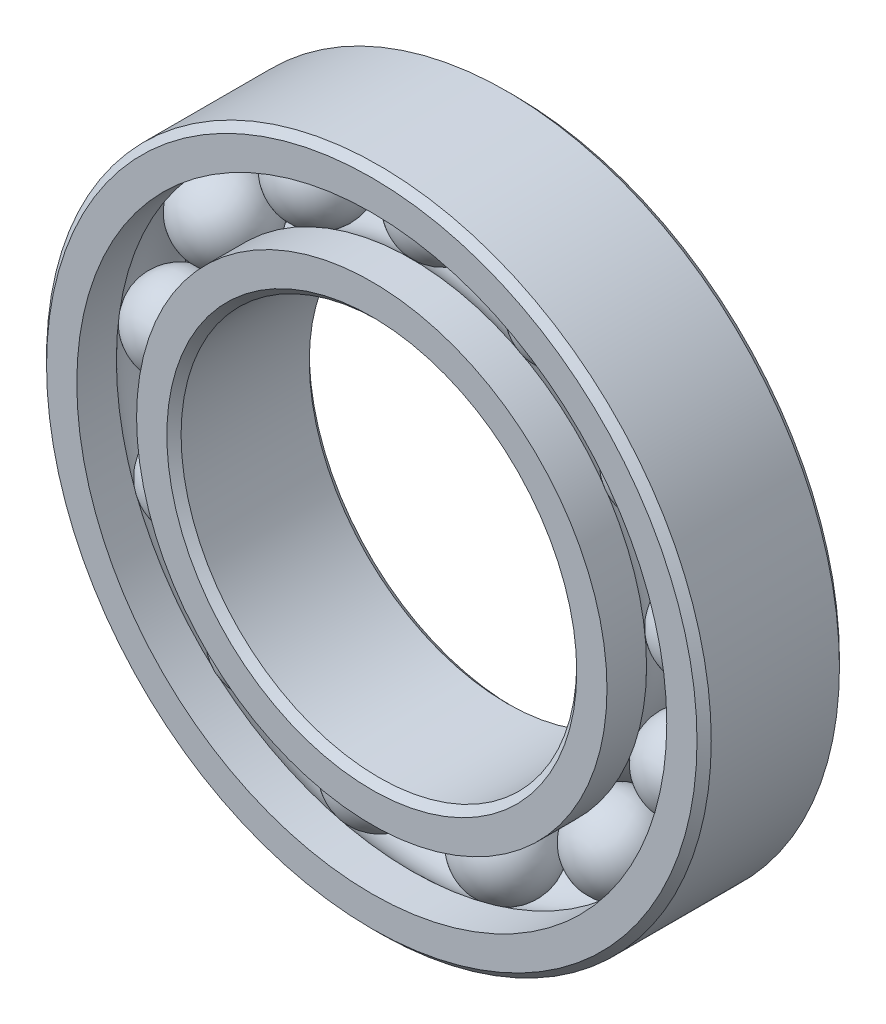
ISO-10303-21;
HEADER;
FILE_DESCRIPTION(('STEP AP214'),'2;1');
FILE_NAME('part.step','',(''),(''),'','','');
FILE_SCHEMA(('AUTOMOTIVE_DESIGN { 1 0 10303 214 1 1 1 1 }'));
ENDSEC;
DATA;
#1=APPLICATION_CONTEXT('core data for automotive mechanical design processes');
#2=APPLICATION_PROTOCOL_DEFINITION('international standard','automotive_design',2000,#1);
#3=PRODUCT_CONTEXT('',#1,'mechanical');
#4=PRODUCT('Part','Part','',(#3));
#5=PRODUCT_RELATED_PRODUCT_CATEGORY('part','',(#4));
#6=PRODUCT_DEFINITION_FORMATION('','',#4);
#7=PRODUCT_DEFINITION_CONTEXT('part definition',#1,'design');
#8=PRODUCT_DEFINITION('design','',#6,#7);
#9=PRODUCT_DEFINITION_SHAPE('','',#8);
#10=(LENGTH_UNIT() NAMED_UNIT(*) SI_UNIT(.MILLI.,.METRE.));
#11=(NAMED_UNIT(*) PLANE_ANGLE_UNIT() SI_UNIT($,.RADIAN.));
#12=(NAMED_UNIT(*) SI_UNIT($,.STERADIAN.) SOLID_ANGLE_UNIT());
#13=UNCERTAINTY_MEASURE_WITH_UNIT(LENGTH_MEASURE(1.E-05),#10,'distance_accuracy_value','');
#14=(GEOMETRIC_REPRESENTATION_CONTEXT(3) GLOBAL_UNCERTAINTY_ASSIGNED_CONTEXT((#13)) GLOBAL_UNIT_ASSIGNED_CONTEXT((#10,
#11,#12)) REPRESENTATION_CONTEXT('',''));
#15=CARTESIAN_POINT('',(0.,0.,0.));
#16=DIRECTION('',(0.,0.,1.));
#17=DIRECTION('',(1.,0.,0.));
#18=AXIS2_PLACEMENT_3D('',#15,#16,#17);
#19=CARTESIAN_POINT('',(7.78411313173294,14.8313884296914,0.));
#20=DIRECTION('',(0.,0.,1.));
#21=DIRECTION('',(0.464723172043757,0.885456025653216,0.));
#22=AXIS2_PLACEMENT_3D('',#19,#20,#21);
#23=SPHERICAL_SURFACE('',#22,2.75098186736443);
#24=CARTESIAN_POINT('',(7.78411313173294,14.8313884296914,2.75098186736443));
#25=VERTEX_POINT('',#24);
#26=VERTEX_LOOP('',#25);
#27=FACE_BOUND('',#26,.T.);
#28=ADVANCED_FACE('F43',(#27),#23,.T.);
#29=CLOSED_SHELL('',(#28));
#30=MANIFOLD_SOLID_BREP('B2',#29);
#31=CARTESIAN_POINT('',(13.7849797537186,9.51508450774703,0.));
#32=DIRECTION('',(0.,0.,1.));
#33=DIRECTION('',(0.822983865893649,0.568064746731166,0.));
#34=AXIS2_PLACEMENT_3D('',#31,#32,#33);
#35=SPHERICAL_SURFACE('',#34,2.75098186736443);
#36=CARTESIAN_POINT('',(13.7849797537186,9.51508450774703,2.75098186736443));
#37=VERTEX_POINT('',#36);
#38=VERTEX_LOOP('',#37);
#39=FACE_BOUND('',#38,.T.);
#40=ADVANCED_FACE('F65',(#39),#35,.T.);
#41=CLOSED_SHELL('',(#40));
#42=MANIFOLD_SOLID_BREP('B6',#41);
#43=CARTESIAN_POINT('',(16.6278736411424,2.01898939427684,0.));
#44=DIRECTION('',(0.,0.,1.));
#45=DIRECTION('',(0.992708874098053,0.120536680255334,0.));
#46=AXIS2_PLACEMENT_3D('',#43,#44,#45);
#47=SPHERICAL_SURFACE('',#46,2.75098186736443);
#48=CARTESIAN_POINT('',(16.6278736411424,2.01898939427684,2.75098186736443));
#49=VERTEX_POINT('',#48);
#50=VERTEX_LOOP('',#49);
#51=FACE_BOUND('',#50,.T.);
#52=ADVANCED_FACE('F87',(#51),#47,.T.);
#53=CLOSED_SHELL('',(#52));
#54=MANIFOLD_SOLID_BREP('B39',#53);
#55=CARTESIAN_POINT('',(15.6615220649808,-5.93963185796232,0.));
#56=DIRECTION('',(0.,0.,1.));
#57=DIRECTION('',(0.935016242685418,-0.354604887042527,0.));
#58=AXIS2_PLACEMENT_3D('',#55,#56,#57);
#59=SPHERICAL_SURFACE('',#58,2.75098186736443);
#60=CARTESIAN_POINT('',(15.6615220649808,-5.93963185796232,2.75098186736443));
#61=VERTEX_POINT('',#60);
#62=VERTEX_LOOP('',#61);
#63=FACE_BOUND('',#62,.T.);
#64=ADVANCED_FACE('F109',(#63),#59,.T.);
#65=CLOSED_SHELL('',(#64));
#66=MANIFOLD_SOLID_BREP('B61',#65);
#67=CARTESIAN_POINT('',(11.1073045255334,-12.5375550318658,0.));
#68=DIRECTION('',(0.,0.,1.));
#69=DIRECTION('',(0.663122658240802,-0.748510748171095,0.));
#70=AXIS2_PLACEMENT_3D('',#67,#68,#69);
#71=SPHERICAL_SURFACE('',#70,2.75098186736443);
#72=CARTESIAN_POINT('',(11.1073045255334,-12.5375550318658,2.75098186736443));
#73=VERTEX_POINT('',#72);
#74=VERTEX_LOOP('',#73);
#75=FACE_BOUND('',#74,.T.);
#76=ADVANCED_FACE('F131',(#75),#71,.T.);
#77=CLOSED_SHELL('',(#76));
#78=MANIFOLD_SOLID_BREP('B83',#77);
#79=CARTESIAN_POINT('',(4.00853737681672,-16.2632754418863,0.));
#80=DIRECTION('',(0.,0.,1.));
#81=DIRECTION('',(0.239315664287565,-0.97094181742605,0.));
#82=AXIS2_PLACEMENT_3D('',#79,#80,#81);
#83=SPHERICAL_SURFACE('',#82,2.75098186736443);
#84=CARTESIAN_POINT('',(4.00853737681672,-16.2632754418863,2.75098186736443));
#85=VERTEX_POINT('',#84);
#86=VERTEX_LOOP('',#85);
#87=FACE_BOUND('',#86,.T.);
#88=ADVANCED_FACE('F153',(#87),#83,.T.);
#89=CLOSED_SHELL('',(#88));
#90=MANIFOLD_SOLID_BREP('B105',#89);
#91=CARTESIAN_POINT('',(-4.00853737681649,-16.2632754418864,0.));
#92=DIRECTION('',(0.,0.,1.));
#93=DIRECTION('',(-0.239315664287552,-0.970941817426054,0.));
#94=AXIS2_PLACEMENT_3D('',#91,#92,#93);
#95=SPHERICAL_SURFACE('',#94,2.75098186736443);
#96=CARTESIAN_POINT('',(-4.00853737681649,-16.2632754418864,2.75098186736443));
#97=VERTEX_POINT('',#96);
#98=VERTEX_LOOP('',#97);
#99=FACE_BOUND('',#98,.T.);
#100=ADVANCED_FACE('F175',(#99),#95,.T.);
#101=CLOSED_SHELL('',(#100));
#102=MANIFOLD_SOLID_BREP('B127',#101);
#103=CARTESIAN_POINT('',(-11.1073045255333,-12.537555031866,0.));
#104=DIRECTION('',(0.,0.,1.));
#105=DIRECTION('',(-0.663122658240791,-0.748510748171105,0.));
#106=AXIS2_PLACEMENT_3D('',#103,#104,#105);
#107=SPHERICAL_SURFACE('',#106,2.75098186736443);
#108=CARTESIAN_POINT('',(-11.1073045255333,-12.537555031866,2.75098186736443));
#109=VERTEX_POINT('',#108);
#110=VERTEX_LOOP('',#109);
#111=FACE_BOUND('',#110,.T.);
#112=ADVANCED_FACE('F197',(#111),#107,.T.);
#113=CLOSED_SHELL('',(#112));
#114=MANIFOLD_SOLID_BREP('B149',#113);
#115=CARTESIAN_POINT('',(-15.6615220649807,-5.93963185796254,0.));
#116=DIRECTION('',(0.,0.,1.));
#117=DIRECTION('',(-0.935016242685413,-0.35460488704254,0.));
#118=AXIS2_PLACEMENT_3D('',#115,#116,#117);
#119=SPHERICAL_SURFACE('',#118,2.75098186736443);
#120=CARTESIAN_POINT('',(-15.6615220649807,-5.93963185796254,2.75098186736443));
#121=VERTEX_POINT('',#120);
#122=VERTEX_LOOP('',#121);
#123=FACE_BOUND('',#122,.T.);
#124=ADVANCED_FACE('F219',(#123),#119,.T.);
#125=CLOSED_SHELL('',(#124));
#126=MANIFOLD_SOLID_BREP('B171',#125);
#127=CARTESIAN_POINT('',(-16.6278736411424,2.01898939427661,0.));
#128=DIRECTION('',(0.,0.,1.));
#129=DIRECTION('',(-0.992708874098054,0.12053668025532,0.));
#130=AXIS2_PLACEMENT_3D('',#127,#128,#129);
#131=SPHERICAL_SURFACE('',#130,2.75098186736443);
#132=CARTESIAN_POINT('',(-16.6278736411424,2.01898939427661,2.75098186736443));
#133=VERTEX_POINT('',#132);
#134=VERTEX_LOOP('',#133);
#135=FACE_BOUND('',#134,.T.);
#136=ADVANCED_FACE('F241',(#135),#131,.T.);
#137=CLOSED_SHELL('',(#136));
#138=MANIFOLD_SOLID_BREP('B193',#137);
#139=CARTESIAN_POINT('',(-13.7849797537188,9.51508450774683,0.));
#140=DIRECTION('',(0.,0.,1.));
#141=DIRECTION('',(-0.822983865893658,0.568064746731154,0.));
#142=AXIS2_PLACEMENT_3D('',#139,#140,#141);
#143=SPHERICAL_SURFACE('',#142,2.75098186736443);
#144=CARTESIAN_POINT('',(-13.7849797537188,9.51508450774683,2.75098186736443));
#145=VERTEX_POINT('',#144);
#146=VERTEX_LOOP('',#145);
#147=FACE_BOUND('',#146,.T.);
#148=ADVANCED_FACE('F263',(#147),#143,.T.);
#149=CLOSED_SHELL('',(#148));
#150=MANIFOLD_SOLID_BREP('B215',#149);
#151=CARTESIAN_POINT('',(-7.78411313173314,14.8313884296913,0.));
#152=DIRECTION('',(0.,0.,1.));
#153=DIRECTION('',(-0.46472317204377,0.885456025653209,0.));
#154=AXIS2_PLACEMENT_3D('',#151,#152,#153);
#155=SPHERICAL_SURFACE('',#154,2.75098186736443);
#156=CARTESIAN_POINT('',(-7.78411313173314,14.8313884296913,2.75098186736443));
#157=VERTEX_POINT('',#156);
#158=VERTEX_LOOP('',#157);
#159=FACE_BOUND('',#158,.T.);
#160=ADVANCED_FACE('F285',(#159),#155,.T.);
#161=CLOSED_SHELL('',(#160));
#162=MANIFOLD_SOLID_BREP('B237',#161);
#163=CARTESIAN_POINT('',(0.,16.75,0.));
#164=DIRECTION('',(0.,0.,1.));
#165=DIRECTION('',(0.,1.,0.));
#166=AXIS2_PLACEMENT_3D('',#163,#164,#165);
#167=SPHERICAL_SURFACE('',#166,2.75098186736443);
#168=CARTESIAN_POINT('',(0.,16.75,2.75098186736443));
#169=VERTEX_POINT('',#168);
#170=VERTEX_LOOP('',#169);
#171=FACE_BOUND('',#170,.T.);
#172=ADVANCED_FACE('F309',(#171),#167,.T.);
#173=CLOSED_SHELL('',(#172));
#174=MANIFOLD_SOLID_BREP('B259',#173);
#175=CARTESIAN_POINT('',(0.,14.8611111111111,4.5));
#176=DIRECTION('',(0.,0.,-1.));
#177=DIRECTION('',(-1.,0.,0.));
#178=AXIS2_PLACEMENT_3D('',#175,#176,#177);
#179=PLANE('',#178);
#180=CARTESIAN_POINT('',(0.,0.,4.5));
#181=DIRECTION('',(0.,0.,1.));
#182=DIRECTION('',(1.,0.,0.));
#183=AXIS2_PLACEMENT_3D('',#180,#181,#182);
#184=CIRCLE('',#183,12.95);
#185=CARTESIAN_POINT('',(12.95,0.,4.5));
#186=VERTEX_POINT('',#185);
#187=EDGE_CURVE('E358',#186,#186,#184,.T.);
#188=ORIENTED_EDGE('',*,*,#187,.F.);
#189=EDGE_LOOP('',(#188));
#190=FACE_BOUND('',#189,.T.);
#191=CARTESIAN_POINT('',(0.,0.,4.5));
#192=DIRECTION('',(0.,0.,1.));
#193=DIRECTION('',(1.,0.,0.));
#194=AXIS2_PLACEMENT_3D('',#191,#192,#193);
#195=CIRCLE('',#194,14.8611111111111);
#196=CARTESIAN_POINT('',(14.8611111111111,0.,4.5));
#197=VERTEX_POINT('',#196);
#198=EDGE_CURVE('E308',#197,#197,#195,.T.);
#199=ORIENTED_EDGE('',*,*,#198,.T.);
#200=EDGE_LOOP('',(#199));
#201=FACE_BOUND('',#200,.T.);
#202=ADVANCED_FACE('F330',(#190,#201),#179,.F.);
#203=CARTESIAN_POINT('',(0.,0.,4.5));
#204=DIRECTION('',(0.,0.,1.));
#205=DIRECTION('',(1.,0.,0.));
#206=AXIS2_PLACEMENT_3D('',#203,#204,#205);
#207=CYLINDRICAL_SURFACE('',#206,14.8611111111111);
#208=ORIENTED_EDGE('',*,*,#198,.F.);
#209=EDGE_LOOP('',(#208));
#210=FACE_BOUND('',#209,.T.);
#211=CARTESIAN_POINT('',(0.,0.,2.));
#212=DIRECTION('',(0.,0.,1.));
#213=DIRECTION('',(1.,0.,0.));
#214=AXIS2_PLACEMENT_3D('',#211,#212,#213);
#215=CIRCLE('',#214,14.8611111111111);
#216=CARTESIAN_POINT('',(14.8611111111111,0.,2.));
#217=VERTEX_POINT('',#216);
#218=EDGE_CURVE('E336',#217,#217,#215,.T.);
#219=ORIENTED_EDGE('',*,*,#218,.T.);
#220=EDGE_LOOP('',(#219));
#221=FACE_BOUND('',#220,.T.);
#222=ADVANCED_FACE('F365',(#210,#221),#207,.T.);
#223=CARTESIAN_POINT('',(0.,0.,0.));
#224=DIRECTION('',(0.,0.,1.));
#225=DIRECTION('',(1.,0.,0.));
#226=AXIS2_PLACEMENT_3D('',#223,#224,#225);
#227=TOROIDAL_SURFACE('',#226,16.75,2.75098186736443);
#228=ORIENTED_EDGE('',*,*,#218,.F.);
#229=EDGE_LOOP('',(#228));
#230=FACE_BOUND('',#229,.T.);
#231=CARTESIAN_POINT('',(0.,0.,-2.));
#232=DIRECTION('',(0.,0.,1.));
#233=DIRECTION('',(1.,0.,0.));
#234=AXIS2_PLACEMENT_3D('',#231,#232,#233);
#235=CIRCLE('',#234,14.8611111111111);
#236=CARTESIAN_POINT('',(14.8611111111111,0.,-2.));
#237=VERTEX_POINT('',#236);
#238=EDGE_CURVE('E340',#237,#237,#235,.T.);
#239=ORIENTED_EDGE('',*,*,#238,.T.);
#240=EDGE_LOOP('',(#239));
#241=FACE_BOUND('',#240,.T.);
#242=ADVANCED_FACE('F369',(#230,#241),#227,.F.);
#243=CARTESIAN_POINT('',(0.,0.,4.5));
#244=DIRECTION('',(0.,0.,1.));
#245=DIRECTION('',(1.,0.,0.));
#246=AXIS2_PLACEMENT_3D('',#243,#244,#245);
#247=CYLINDRICAL_SURFACE('',#246,14.8611111111111);
#248=ORIENTED_EDGE('',*,*,#238,.F.);
#249=EDGE_LOOP('',(#248));
#250=FACE_BOUND('',#249,.T.);
#251=CARTESIAN_POINT('',(0.,0.,-4.5));
#252=DIRECTION('',(0.,0.,1.));
#253=DIRECTION('',(1.,0.,0.));
#254=AXIS2_PLACEMENT_3D('',#251,#252,#253);
#255=CIRCLE('',#254,14.8611111111111);
#256=CARTESIAN_POINT('',(14.8611111111111,0.,-4.5));
#257=VERTEX_POINT('',#256);
#258=EDGE_CURVE('E344',#257,#257,#255,.T.);
#259=ORIENTED_EDGE('',*,*,#258,.T.);
#260=EDGE_LOOP('',(#259));
#261=FACE_BOUND('',#260,.T.);
#262=ADVANCED_FACE('F374',(#250,#261),#247,.T.);
#263=CARTESIAN_POINT('',(0.,12.95,-4.5));
#264=DIRECTION('',(0.,0.,1.));
#265=DIRECTION('',(1.,0.,0.));
#266=AXIS2_PLACEMENT_3D('',#263,#264,#265);
#267=PLANE('',#266);
#268=ORIENTED_EDGE('',*,*,#258,.F.);
#269=EDGE_LOOP('',(#268));
#270=FACE_BOUND('',#269,.T.);
#271=CARTESIAN_POINT('',(0.,0.,-4.5));
#272=DIRECTION('',(0.,0.,1.));
#273=DIRECTION('',(1.,0.,0.));
#274=AXIS2_PLACEMENT_3D('',#271,#272,#273);
#275=CIRCLE('',#274,12.95);
#276=CARTESIAN_POINT('',(12.95,0.,-4.5));
#277=VERTEX_POINT('',#276);
#278=EDGE_CURVE('E349',#277,#277,#275,.T.);
#279=ORIENTED_EDGE('',*,*,#278,.T.);
#280=EDGE_LOOP('',(#279));
#281=FACE_BOUND('',#280,.T.);
#282=ADVANCED_FACE('F380',(#270,#281),#267,.F.);
#283=CARTESIAN_POINT('',(0.,0.,-4.05));
#284=DIRECTION('',(0.,0.,-1.));
#285=DIRECTION('',(-1.,0.,0.));
#286=AXIS2_PLACEMENT_3D('',#283,#284,#285);
#287=CONICAL_SURFACE('',#286,12.5,0.785398163397448);
#288=ORIENTED_EDGE('',*,*,#278,.F.);
#289=EDGE_LOOP('',(#288));
#290=FACE_BOUND('',#289,.T.);
#291=CARTESIAN_POINT('',(0.,0.,-4.05));
#292=DIRECTION('',(0.,0.,1.));
#293=DIRECTION('',(1.,0.,0.));
#294=AXIS2_PLACEMENT_3D('',#291,#292,#293);
#295=CIRCLE('',#294,12.5);
#296=CARTESIAN_POINT('',(12.5,0.,-4.05));
#297=VERTEX_POINT('',#296);
#298=EDGE_CURVE('E352',#297,#297,#295,.T.);
#299=ORIENTED_EDGE('',*,*,#298,.T.);
#300=EDGE_LOOP('',(#299));
#301=FACE_BOUND('',#300,.T.);
#302=ADVANCED_FACE('F384',(#290,#301),#287,.F.);
#303=CARTESIAN_POINT('',(0.,0.,4.5));
#304=DIRECTION('',(0.,0.,1.));
#305=DIRECTION('',(1.,0.,0.));
#306=AXIS2_PLACEMENT_3D('',#303,#304,#305);
#307=CYLINDRICAL_SURFACE('',#306,12.5);
#308=ORIENTED_EDGE('',*,*,#298,.F.);
#309=EDGE_LOOP('',(#308));
#310=FACE_BOUND('',#309,.T.);
#311=CARTESIAN_POINT('',(0.,0.,4.05));
#312=DIRECTION('',(0.,0.,1.));
#313=DIRECTION('',(1.,0.,0.));
#314=AXIS2_PLACEMENT_3D('',#311,#312,#313);
#315=CIRCLE('',#314,12.5);
#316=CARTESIAN_POINT('',(12.5,0.,4.05));
#317=VERTEX_POINT('',#316);
#318=EDGE_CURVE('E355',#317,#317,#315,.T.);
#319=ORIENTED_EDGE('',*,*,#318,.T.);
#320=EDGE_LOOP('',(#319));
#321=FACE_BOUND('',#320,.T.);
#322=ADVANCED_FACE('F388',(#310,#321),#307,.F.);
#323=CARTESIAN_POINT('',(0.,0.,4.5));
#324=DIRECTION('',(0.,0.,1.));
#325=DIRECTION('',(1.,0.,0.));
#326=AXIS2_PLACEMENT_3D('',#323,#324,#325);
#327=CONICAL_SURFACE('',#326,12.95,0.785398163397449);
#328=ORIENTED_EDGE('',*,*,#318,.F.);
#329=EDGE_LOOP('',(#328));
#330=FACE_BOUND('',#329,.T.);
#331=ORIENTED_EDGE('',*,*,#187,.T.);
#332=EDGE_LOOP('',(#331));
#333=FACE_BOUND('',#332,.T.);
#334=ADVANCED_FACE('F362',(#330,#333),#327,.F.);
#335=CLOSED_SHELL('',(#202,#222,#242,#262,#282,#302,#322,#334));
#336=MANIFOLD_SOLID_BREP('B281',#335);
#337=CARTESIAN_POINT('',(0.,0.,4.05));
#338=DIRECTION('',(0.,0.,-1.));
#339=DIRECTION('',(-1.,0.,0.));
#340=AXIS2_PLACEMENT_3D('',#337,#338,#339);
#341=CONICAL_SURFACE('',#340,21.,0.785398163397449);
#342=CARTESIAN_POINT('',(0.,0.,4.5));
#343=DIRECTION('',(0.,0.,1.));
#344=DIRECTION('',(1.,0.,0.));
#345=AXIS2_PLACEMENT_3D('',#342,#343,#344);
#346=CIRCLE('',#345,20.55);
#347=CARTESIAN_POINT('',(20.55,0.,4.5));
#348=VERTEX_POINT('',#347);
#349=EDGE_CURVE('E495',#348,#348,#346,.T.);
#350=ORIENTED_EDGE('',*,*,#349,.F.);
#351=EDGE_LOOP('',(#350));
#352=FACE_BOUND('',#351,.T.);
#353=CARTESIAN_POINT('',(0.,0.,4.05));
#354=DIRECTION('',(0.,0.,1.));
#355=DIRECTION('',(1.,0.,0.));
#356=AXIS2_PLACEMENT_3D('',#353,#354,#355);
#357=CIRCLE('',#356,21.);
#358=CARTESIAN_POINT('',(21.,0.,4.05));
#359=VERTEX_POINT('',#358);
#360=EDGE_CURVE('E329',#359,#359,#357,.T.);
#361=ORIENTED_EDGE('',*,*,#360,.T.);
#362=EDGE_LOOP('',(#361));
#363=FACE_BOUND('',#362,.T.);
#364=ADVANCED_FACE('F467',(#352,#363),#341,.T.);
#365=CARTESIAN_POINT('',(0.,0.,4.5));
#366=DIRECTION('',(0.,0.,1.));
#367=DIRECTION('',(1.,0.,0.));
#368=AXIS2_PLACEMENT_3D('',#365,#366,#367);
#369=CYLINDRICAL_SURFACE('',#368,21.);
#370=ORIENTED_EDGE('',*,*,#360,.F.);
#371=EDGE_LOOP('',(#370));
#372=FACE_BOUND('',#371,.T.);
#373=CARTESIAN_POINT('',(0.,0.,-4.05));
#374=DIRECTION('',(0.,0.,1.));
#375=DIRECTION('',(1.,0.,0.));
#376=AXIS2_PLACEMENT_3D('',#373,#374,#375);
#377=CIRCLE('',#376,21.);
#378=CARTESIAN_POINT('',(21.,0.,-4.05));
#379=VERTEX_POINT('',#378);
#380=EDGE_CURVE('E473',#379,#379,#377,.T.);
#381=ORIENTED_EDGE('',*,*,#380,.T.);
#382=EDGE_LOOP('',(#381));
#383=FACE_BOUND('',#382,.T.);
#384=ADVANCED_FACE('F502',(#372,#383),#369,.T.);
#385=CARTESIAN_POINT('',(0.,0.,-4.5));
#386=DIRECTION('',(0.,0.,1.));
#387=DIRECTION('',(1.,0.,0.));
#388=AXIS2_PLACEMENT_3D('',#385,#386,#387);
#389=CONICAL_SURFACE('',#388,20.55,0.785398163397448);
#390=ORIENTED_EDGE('',*,*,#380,.F.);
#391=EDGE_LOOP('',(#390));
#392=FACE_BOUND('',#391,.T.);
#393=CARTESIAN_POINT('',(0.,0.,-4.5));
#394=DIRECTION('',(0.,0.,1.));
#395=DIRECTION('',(1.,0.,0.));
#396=AXIS2_PLACEMENT_3D('',#393,#394,#395);
#397=CIRCLE('',#396,20.55);
#398=CARTESIAN_POINT('',(20.55,0.,-4.5));
#399=VERTEX_POINT('',#398);
#400=EDGE_CURVE('E477',#399,#399,#397,.T.);
#401=ORIENTED_EDGE('',*,*,#400,.T.);
#402=EDGE_LOOP('',(#401));
#403=FACE_BOUND('',#402,.T.);
#404=ADVANCED_FACE('F506',(#392,#403),#389,.T.);
#405=CARTESIAN_POINT('',(0.,20.55,-4.5));
#406=DIRECTION('',(0.,0.,1.));
#407=DIRECTION('',(1.,0.,0.));
#408=AXIS2_PLACEMENT_3D('',#405,#406,#407);
#409=PLANE('',#408);
#410=ORIENTED_EDGE('',*,*,#400,.F.);
#411=EDGE_LOOP('',(#410));
#412=FACE_BOUND('',#411,.T.);
#413=CARTESIAN_POINT('',(0.,0.,-4.5));
#414=DIRECTION('',(0.,0.,1.));
#415=DIRECTION('',(1.,0.,0.));
#416=AXIS2_PLACEMENT_3D('',#413,#414,#415);
#417=CIRCLE('',#416,18.6388888888889);
#418=CARTESIAN_POINT('',(18.6388888888889,0.,-4.5));
#419=VERTEX_POINT('',#418);
#420=EDGE_CURVE('E481',#419,#419,#417,.T.);
#421=ORIENTED_EDGE('',*,*,#420,.T.);
#422=EDGE_LOOP('',(#421));
#423=FACE_BOUND('',#422,.T.);
#424=ADVANCED_FACE('F511',(#412,#423),#409,.F.);
#425=CARTESIAN_POINT('',(0.,0.,4.5));
#426=DIRECTION('',(0.,0.,1.));
#427=DIRECTION('',(1.,0.,0.));
#428=AXIS2_PLACEMENT_3D('',#425,#426,#427);
#429=CYLINDRICAL_SURFACE('',#428,18.6388888888889);
#430=ORIENTED_EDGE('',*,*,#420,.F.);
#431=EDGE_LOOP('',(#430));
#432=FACE_BOUND('',#431,.T.);
#433=CARTESIAN_POINT('',(0.,0.,-2.));
#434=DIRECTION('',(0.,0.,1.));
#435=DIRECTION('',(1.,0.,0.));
#436=AXIS2_PLACEMENT_3D('',#433,#434,#435);
#437=CIRCLE('',#436,18.6388888888889);
#438=CARTESIAN_POINT('',(18.6388888888889,0.,-2.));
#439=VERTEX_POINT('',#438);
#440=EDGE_CURVE('E486',#439,#439,#437,.T.);
#441=ORIENTED_EDGE('',*,*,#440,.T.);
#442=EDGE_LOOP('',(#441));
#443=FACE_BOUND('',#442,.T.);
#444=ADVANCED_FACE('F517',(#432,#443),#429,.F.);
#445=CARTESIAN_POINT('',(0.,0.,0.));
#446=DIRECTION('',(0.,0.,1.));
#447=DIRECTION('',(1.,0.,0.));
#448=AXIS2_PLACEMENT_3D('',#445,#446,#447);
#449=TOROIDAL_SURFACE('',#448,16.75,2.75098186736443);
#450=ORIENTED_EDGE('',*,*,#440,.F.);
#451=EDGE_LOOP('',(#450));
#452=FACE_BOUND('',#451,.T.);
#453=CARTESIAN_POINT('',(0.,0.,2.));
#454=DIRECTION('',(0.,0.,1.));
#455=DIRECTION('',(1.,0.,0.));
#456=AXIS2_PLACEMENT_3D('',#453,#454,#455);
#457=CIRCLE('',#456,18.6388888888889);
#458=CARTESIAN_POINT('',(18.6388888888889,0.,2.));
#459=VERTEX_POINT('',#458);
#460=EDGE_CURVE('E489',#459,#459,#457,.T.);
#461=ORIENTED_EDGE('',*,*,#460,.T.);
#462=EDGE_LOOP('',(#461));
#463=FACE_BOUND('',#462,.T.);
#464=ADVANCED_FACE('F521',(#452,#463),#449,.F.);
#465=CARTESIAN_POINT('',(0.,0.,4.5));
#466=DIRECTION('',(0.,0.,1.));
#467=DIRECTION('',(1.,0.,0.));
#468=AXIS2_PLACEMENT_3D('',#465,#466,#467);
#469=CYLINDRICAL_SURFACE('',#468,18.6388888888889);
#470=ORIENTED_EDGE('',*,*,#460,.F.);
#471=EDGE_LOOP('',(#470));
#472=FACE_BOUND('',#471,.T.);
#473=CARTESIAN_POINT('',(0.,0.,4.5));
#474=DIRECTION('',(0.,0.,1.));
#475=DIRECTION('',(1.,0.,0.));
#476=AXIS2_PLACEMENT_3D('',#473,#474,#475);
#477=CIRCLE('',#476,18.6388888888889);
#478=CARTESIAN_POINT('',(18.6388888888889,0.,4.5));
#479=VERTEX_POINT('',#478);
#480=EDGE_CURVE('E492',#479,#479,#477,.T.);
#481=ORIENTED_EDGE('',*,*,#480,.T.);
#482=EDGE_LOOP('',(#481));
#483=FACE_BOUND('',#482,.T.);
#484=ADVANCED_FACE('F525',(#472,#483),#469,.F.);
#485=CARTESIAN_POINT('',(0.,20.55,4.5));
#486=DIRECTION('',(0.,0.,-1.));
#487=DIRECTION('',(-1.,0.,0.));
#488=AXIS2_PLACEMENT_3D('',#485,#486,#487);
#489=PLANE('',#488);
#490=ORIENTED_EDGE('',*,*,#480,.F.);
#491=EDGE_LOOP('',(#490));
#492=FACE_BOUND('',#491,.T.);
#493=ORIENTED_EDGE('',*,*,#349,.T.);
#494=EDGE_LOOP('',(#493));
#495=FACE_BOUND('',#494,.T.);
#496=ADVANCED_FACE('F499',(#492,#495),#489,.F.);
#497=CLOSED_SHELL('',(#364,#384,#404,#424,#444,#464,#484,#496));
#498=MANIFOLD_SOLID_BREP('B303',#497);
#499=ADVANCED_BREP_SHAPE_REPRESENTATION('',(#18,#30,#42,#54,#66,#78,#90,#102,#114,#126,#138,
#150,#162,#174,#336,#498),#14);
#500=SHAPE_DEFINITION_REPRESENTATION(#9,#499);
ENDSEC;
END-ISO-10303-21;
